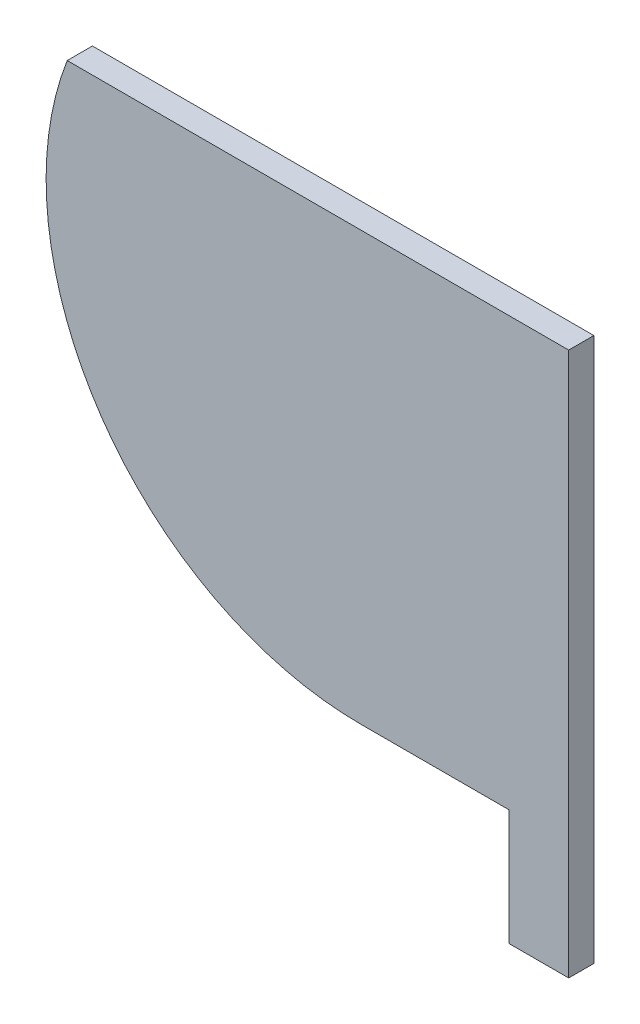
ISO-10303-21;
HEADER;
FILE_DESCRIPTION(('STEP AP214'),'2;1');
FILE_NAME('part.step','',(''),(''),'','','');
FILE_SCHEMA(('AUTOMOTIVE_DESIGN { 1 0 10303 214 1 1 1 1 }'));
ENDSEC;
DATA;
#1=APPLICATION_CONTEXT('core data for automotive mechanical design processes');
#2=APPLICATION_PROTOCOL_DEFINITION('international standard','automotive_design',2000,#1);
#3=PRODUCT_CONTEXT('',#1,'mechanical');
#4=PRODUCT('Part','Part','',(#3));
#5=PRODUCT_RELATED_PRODUCT_CATEGORY('part','',(#4));
#6=PRODUCT_DEFINITION_FORMATION('','',#4);
#7=PRODUCT_DEFINITION_CONTEXT('part definition',#1,'design');
#8=PRODUCT_DEFINITION('design','',#6,#7);
#9=PRODUCT_DEFINITION_SHAPE('','',#8);
#10=(LENGTH_UNIT() NAMED_UNIT(*) SI_UNIT(.MILLI.,.METRE.));
#11=(NAMED_UNIT(*) PLANE_ANGLE_UNIT() SI_UNIT($,.RADIAN.));
#12=(NAMED_UNIT(*) SI_UNIT($,.STERADIAN.) SOLID_ANGLE_UNIT());
#13=UNCERTAINTY_MEASURE_WITH_UNIT(LENGTH_MEASURE(1.E-05),#10,'distance_accuracy_value','');
#14=(GEOMETRIC_REPRESENTATION_CONTEXT(3) GLOBAL_UNCERTAINTY_ASSIGNED_CONTEXT((#13)) GLOBAL_UNIT_ASSIGNED_CONTEXT((#10,
#11,#12)) REPRESENTATION_CONTEXT('',''));
#15=CARTESIAN_POINT('',(0.,0.,0.));
#16=DIRECTION('',(0.,0.,1.));
#17=DIRECTION('',(1.,0.,0.));
#18=AXIS2_PLACEMENT_3D('',#15,#16,#17);
#19=CARTESIAN_POINT('',(-41.2805747146211,-85.,5.));
#20=DIRECTION('',(0.,1.,0.));
#21=DIRECTION('',(0.,0.,1.));
#22=AXIS2_PLACEMENT_3D('',#19,#20,#21);
#23=PLANE('',#22);
#24=DIRECTION('',(1.,0.,0.));
#25=VECTOR('',#24,1.);
#26=CARTESIAN_POINT('',(-41.2805747146211,-85.,0.));
#27=LINE('',#26,#25);
#28=CARTESIAN_POINT('',(-41.2805747146211,-85.,0.));
#29=VERTEX_POINT('',#28);
#30=CARTESIAN_POINT('',(-11.8801822065285,-85.,0.));
#31=VERTEX_POINT('',#30);
#32=EDGE_CURVE('E54',#29,#31,#27,.T.);
#33=ORIENTED_EDGE('',*,*,#32,.T.);
#34=DIRECTION('',(0.,0.,1.));
#35=VECTOR('',#34,1.);
#36=CARTESIAN_POINT('',(-11.8801822065285,-85.,0.));
#37=LINE('',#36,#35);
#38=CARTESIAN_POINT('',(-11.8801822065285,-85.,5.));
#39=VERTEX_POINT('',#38);
#40=EDGE_CURVE('E49',#31,#39,#37,.T.);
#41=ORIENTED_EDGE('',*,*,#40,.T.);
#42=DIRECTION('',(1.,0.,0.));
#43=VECTOR('',#42,1.);
#44=CARTESIAN_POINT('',(-41.2805747146211,-85.,5.));
#45=LINE('',#44,#43);
#46=CARTESIAN_POINT('',(-41.2805747146211,-85.,5.));
#47=VERTEX_POINT('',#46);
#48=EDGE_CURVE('E116',#47,#39,#45,.T.);
#49=ORIENTED_EDGE('',*,*,#48,.F.);
#50=DIRECTION('',(0.,0.,-1.));
#51=VECTOR('',#50,1.);
#52=CARTESIAN_POINT('',(-41.2805747146211,-85.,5.));
#53=LINE('',#52,#51);
#54=EDGE_CURVE('E125',#47,#29,#53,.T.);
#55=ORIENTED_EDGE('',*,*,#54,.T.);
#56=EDGE_LOOP('',(#33,#41,#49,#55));
#57=FACE_BOUND('',#56,.T.);
#58=ADVANCED_FACE('F35',(#57),#23,.F.);
#59=CARTESIAN_POINT('',(0.,0.,5.));
#60=DIRECTION('',(-1.,0.,0.));
#61=DIRECTION('',(0.,-1.,0.));
#62=AXIS2_PLACEMENT_3D('',#59,#60,#61);
#63=PLANE('',#62);
#64=DIRECTION('',(0.,1.,0.));
#65=VECTOR('',#64,1.);
#66=CARTESIAN_POINT('',(0.,0.,0.));
#67=LINE('',#66,#65);
#68=CARTESIAN_POINT('',(0.,-108.,0.));
#69=VERTEX_POINT('',#68);
#70=CARTESIAN_POINT('',(0.,0.,0.));
#71=VERTEX_POINT('',#70);
#72=EDGE_CURVE('E105',#69,#71,#67,.T.);
#73=ORIENTED_EDGE('',*,*,#72,.T.);
#74=DIRECTION('',(0.,0.,-1.));
#75=VECTOR('',#74,1.);
#76=CARTESIAN_POINT('',(0.,0.,5.));
#77=LINE('',#76,#75);
#78=CARTESIAN_POINT('',(0.,0.,5.));
#79=VERTEX_POINT('',#78);
#80=EDGE_CURVE('E11',#79,#71,#77,.T.);
#81=ORIENTED_EDGE('',*,*,#80,.F.);
#82=DIRECTION('',(0.,1.,0.));
#83=VECTOR('',#82,1.);
#84=CARTESIAN_POINT('',(0.,0.,5.));
#85=LINE('',#84,#83);
#86=CARTESIAN_POINT('',(0.,-108.,5.));
#87=VERTEX_POINT('',#86);
#88=EDGE_CURVE('E118',#87,#79,#85,.T.);
#89=ORIENTED_EDGE('',*,*,#88,.F.);
#90=DIRECTION('',(0.,0.,1.));
#91=VECTOR('',#90,1.);
#92=CARTESIAN_POINT('',(0.,-108.,0.));
#93=LINE('',#92,#91);
#94=EDGE_CURVE('E98',#69,#87,#93,.T.);
#95=ORIENTED_EDGE('',*,*,#94,.F.);
#96=EDGE_LOOP('',(#73,#81,#89,#95));
#97=FACE_BOUND('',#96,.T.);
#98=ADVANCED_FACE('F143',(#97),#63,.F.);
#99=CARTESIAN_POINT('',(0.,0.,5.));
#100=DIRECTION('',(0.,-1.,0.));
#101=DIRECTION('',(1.,0.,0.));
#102=AXIS2_PLACEMENT_3D('',#99,#100,#101);
#103=PLANE('',#102);
#104=DIRECTION('',(-1.,0.,0.));
#105=VECTOR('',#104,1.);
#106=CARTESIAN_POINT('',(0.,0.,0.));
#107=LINE('',#106,#105);
#108=CARTESIAN_POINT('',(-99.5900936630741,0.,0.));
#109=VERTEX_POINT('',#108);
#110=EDGE_CURVE('E128',#71,#109,#107,.T.);
#111=ORIENTED_EDGE('',*,*,#110,.T.);
#112=DIRECTION('',(0.,0.,-1.));
#113=VECTOR('',#112,1.);
#114=CARTESIAN_POINT('',(-99.5900936630741,0.,5.));
#115=LINE('',#114,#113);
#116=CARTESIAN_POINT('',(-99.5900936630741,0.,5.));
#117=VERTEX_POINT('',#116);
#118=EDGE_CURVE('E42',#117,#109,#115,.T.);
#119=ORIENTED_EDGE('',*,*,#118,.F.);
#120=DIRECTION('',(-1.,0.,0.));
#121=VECTOR('',#120,1.);
#122=CARTESIAN_POINT('',(0.,0.,5.));
#123=LINE('',#122,#121);
#124=EDGE_CURVE('E121',#79,#117,#123,.T.);
#125=ORIENTED_EDGE('',*,*,#124,.F.);
#126=ORIENTED_EDGE('',*,*,#80,.T.);
#127=EDGE_LOOP('',(#111,#119,#125,#126));
#128=FACE_BOUND('',#127,.T.);
#129=ADVANCED_FACE('F140',(#128),#103,.F.);
#130=CARTESIAN_POINT('',(-41.2805747146211,-22.5,5.));
#131=DIRECTION('',(0.,0.,-1.));
#132=DIRECTION('',(-1.,0.,0.));
#133=AXIS2_PLACEMENT_3D('',#130,#131,#132);
#134=CYLINDRICAL_SURFACE('',#133,62.5);
#135=CARTESIAN_POINT('',(-41.2805747146211,-22.5,0.));
#136=DIRECTION('',(0.,0.,1.));
#137=DIRECTION('',(1.,0.,0.));
#138=AXIS2_PLACEMENT_3D('',#135,#136,#137);
#139=CIRCLE('',#138,62.5);
#140=EDGE_CURVE('E119',#109,#29,#139,.T.);
#141=ORIENTED_EDGE('',*,*,#140,.T.);
#142=ORIENTED_EDGE('',*,*,#54,.F.);
#143=CARTESIAN_POINT('',(-41.2805747146211,-22.5,5.));
#144=DIRECTION('',(0.,0.,1.));
#145=DIRECTION('',(1.,0.,0.));
#146=AXIS2_PLACEMENT_3D('',#143,#144,#145);
#147=CIRCLE('',#146,62.5);
#148=EDGE_CURVE('E123',#117,#47,#147,.T.);
#149=ORIENTED_EDGE('',*,*,#148,.F.);
#150=ORIENTED_EDGE('',*,*,#118,.T.);
#151=EDGE_LOOP('',(#141,#142,#149,#150));
#152=FACE_BOUND('',#151,.T.);
#153=ADVANCED_FACE('F136',(#152),#134,.T.);
#154=CARTESIAN_POINT('',(-41.2805747146211,-22.5,5.));
#155=DIRECTION('',(0.,0.,1.));
#156=DIRECTION('',(1.,0.,0.));
#157=AXIS2_PLACEMENT_3D('',#154,#155,#156);
#158=PLANE('',#157);
#159=ORIENTED_EDGE('',*,*,#48,.T.);
#160=DIRECTION('',(0.,-1.,0.));
#161=VECTOR('',#160,1.);
#162=CARTESIAN_POINT('',(-11.8801822065285,-85.,5.));
#163=LINE('',#162,#161);
#164=CARTESIAN_POINT('',(-11.8801822065285,-108.,5.));
#165=VERTEX_POINT('',#164);
#166=EDGE_CURVE('E110',#39,#165,#163,.T.);
#167=ORIENTED_EDGE('',*,*,#166,.T.);
#168=DIRECTION('',(1.,0.,0.));
#169=VECTOR('',#168,1.);
#170=CARTESIAN_POINT('',(-11.8801822065285,-108.,5.));
#171=LINE('',#170,#169);
#172=EDGE_CURVE('E93',#165,#87,#171,.T.);
#173=ORIENTED_EDGE('',*,*,#172,.T.);
#174=ORIENTED_EDGE('',*,*,#88,.T.);
#175=ORIENTED_EDGE('',*,*,#124,.T.);
#176=ORIENTED_EDGE('',*,*,#148,.T.);
#177=EDGE_LOOP('',(#159,#167,#173,#174,#175,#176));
#178=FACE_BOUND('',#177,.T.);
#179=ADVANCED_FACE('F145',(#178),#158,.T.);
#180=CARTESIAN_POINT('',(-41.2805747146211,-22.5,0.));
#181=DIRECTION('',(0.,0.,1.));
#182=DIRECTION('',(1.,0.,0.));
#183=AXIS2_PLACEMENT_3D('',#180,#181,#182);
#184=PLANE('',#183);
#185=ORIENTED_EDGE('',*,*,#32,.F.);
#186=ORIENTED_EDGE('',*,*,#140,.F.);
#187=ORIENTED_EDGE('',*,*,#110,.F.);
#188=ORIENTED_EDGE('',*,*,#72,.F.);
#189=DIRECTION('',(1.,0.,0.));
#190=VECTOR('',#189,1.);
#191=CARTESIAN_POINT('',(-11.8801822065285,-108.,0.));
#192=LINE('',#191,#190);
#193=CARTESIAN_POINT('',(-11.8801822065285,-108.,0.));
#194=VERTEX_POINT('',#193);
#195=EDGE_CURVE('E91',#194,#69,#192,.T.);
#196=ORIENTED_EDGE('',*,*,#195,.F.);
#197=DIRECTION('',(0.,-1.,0.));
#198=VECTOR('',#197,1.);
#199=CARTESIAN_POINT('',(-11.8801822065285,-85.,0.));
#200=LINE('',#199,#198);
#201=EDGE_CURVE('E103',#31,#194,#200,.T.);
#202=ORIENTED_EDGE('',*,*,#201,.F.);
#203=EDGE_LOOP('',(#185,#186,#187,#188,#196,#202));
#204=FACE_BOUND('',#203,.T.);
#205=ADVANCED_FACE('F102',(#204),#184,.F.);
#206=CARTESIAN_POINT('',(-11.8801822065285,-108.,0.));
#207=DIRECTION('',(0.,-1.,0.));
#208=DIRECTION('',(0.,0.,-1.));
#209=AXIS2_PLACEMENT_3D('',#206,#207,#208);
#210=PLANE('',#209);
#211=ORIENTED_EDGE('',*,*,#172,.F.);
#212=DIRECTION('',(0.,0.,1.));
#213=VECTOR('',#212,1.);
#214=CARTESIAN_POINT('',(-11.8801822065285,-108.,0.));
#215=LINE('',#214,#213);
#216=EDGE_CURVE('E87',#194,#165,#215,.T.);
#217=ORIENTED_EDGE('',*,*,#216,.F.);
#218=ORIENTED_EDGE('',*,*,#195,.T.);
#219=ORIENTED_EDGE('',*,*,#94,.T.);
#220=EDGE_LOOP('',(#211,#217,#218,#219));
#221=FACE_BOUND('',#220,.T.);
#222=ADVANCED_FACE('F89',(#221),#210,.T.);
#223=CARTESIAN_POINT('',(-11.8801822065285,-85.,0.));
#224=DIRECTION('',(-1.,0.,0.));
#225=DIRECTION('',(0.,-1.,0.));
#226=AXIS2_PLACEMENT_3D('',#223,#224,#225);
#227=PLANE('',#226);
#228=ORIENTED_EDGE('',*,*,#166,.F.);
#229=ORIENTED_EDGE('',*,*,#40,.F.);
#230=ORIENTED_EDGE('',*,*,#201,.T.);
#231=ORIENTED_EDGE('',*,*,#216,.T.);
#232=EDGE_LOOP('',(#228,#229,#230,#231));
#233=FACE_BOUND('',#232,.T.);
#234=ADVANCED_FACE('F108',(#233),#227,.T.);
#235=CLOSED_SHELL('',(#58,#98,#129,#153,#179,#205,#222,#234));
#236=MANIFOLD_SOLID_BREP('B2',#235);
#237=ADVANCED_BREP_SHAPE_REPRESENTATION('',(#18,#236),#14);
#238=SHAPE_DEFINITION_REPRESENTATION(#9,#237);
ENDSEC;
END-ISO-10303-21;
